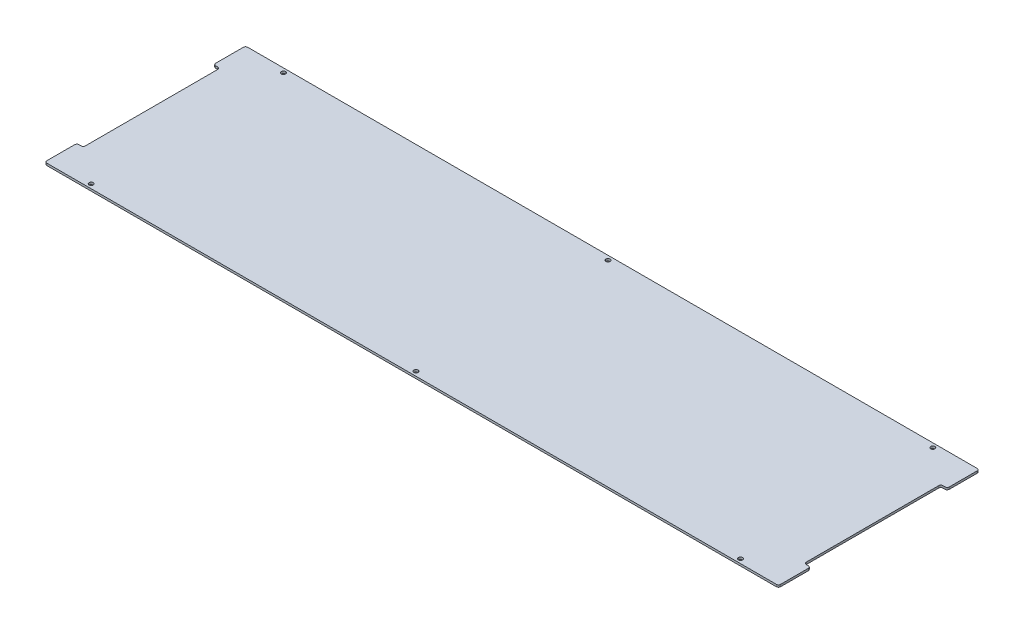
ISO-10303-21;
HEADER;
FILE_DESCRIPTION(('STEP AP214'),'2;1');
FILE_NAME('part.step','',(''),(''),'','','');
FILE_SCHEMA(('AUTOMOTIVE_DESIGN { 1 0 10303 214 1 1 1 1 }'));
ENDSEC;
DATA;
#1=APPLICATION_CONTEXT('core data for automotive mechanical design processes');
#2=APPLICATION_PROTOCOL_DEFINITION('international standard','automotive_design',2000,#1);
#3=PRODUCT_CONTEXT('',#1,'mechanical');
#4=PRODUCT('Part','Part','',(#3));
#5=PRODUCT_RELATED_PRODUCT_CATEGORY('part','',(#4));
#6=PRODUCT_DEFINITION_FORMATION('','',#4);
#7=PRODUCT_DEFINITION_CONTEXT('part definition',#1,'design');
#8=PRODUCT_DEFINITION('design','',#6,#7);
#9=PRODUCT_DEFINITION_SHAPE('','',#8);
#10=(LENGTH_UNIT() NAMED_UNIT(*) SI_UNIT(.MILLI.,.METRE.));
#11=(NAMED_UNIT(*) PLANE_ANGLE_UNIT() SI_UNIT($,.RADIAN.));
#12=(NAMED_UNIT(*) SI_UNIT($,.STERADIAN.) SOLID_ANGLE_UNIT());
#13=UNCERTAINTY_MEASURE_WITH_UNIT(LENGTH_MEASURE(1.E-05),#10,'distance_accuracy_value','');
#14=(GEOMETRIC_REPRESENTATION_CONTEXT(3) GLOBAL_UNCERTAINTY_ASSIGNED_CONTEXT((#13)) GLOBAL_UNIT_ASSIGNED_CONTEXT((#10,
#11,#12)) REPRESENTATION_CONTEXT('',''));
#15=CARTESIAN_POINT('',(0.,0.,0.));
#16=DIRECTION('',(0.,0.,1.));
#17=DIRECTION('',(1.,0.,0.));
#18=AXIS2_PLACEMENT_3D('',#15,#16,#17);
#19=CARTESIAN_POINT('',(0.,3.175,0.));
#20=DIRECTION('',(0.,-1.,0.));
#21=DIRECTION('',(0.,0.,-1.));
#22=AXIS2_PLACEMENT_3D('',#19,#20,#21);
#23=PLANE('',#22);
#24=CARTESIAN_POINT('',(482.6,3.175,142.875));
#25=DIRECTION('',(0.,1.,0.));
#26=DIRECTION('',(0.,0.,1.));
#27=AXIS2_PLACEMENT_3D('',#24,#25,#26);
#28=CIRCLE('',#27,3.17499999999998);
#29=CARTESIAN_POINT('',(482.6,3.175,146.05));
#30=VERTEX_POINT('',#29);
#31=EDGE_CURVE('E630',#30,#30,#28,.T.);
#32=ORIENTED_EDGE('',*,*,#31,.F.);
#33=EDGE_LOOP('',(#32));
#34=FACE_BOUND('',#33,.T.);
#35=CARTESIAN_POINT('',(-482.6,3.175,142.875));
#36=DIRECTION('',(0.,1.,0.));
#37=DIRECTION('',(0.,0.,1.));
#38=AXIS2_PLACEMENT_3D('',#35,#36,#37);
#39=CIRCLE('',#38,3.17499999999998);
#40=CARTESIAN_POINT('',(-482.6,3.175,146.05));
#41=VERTEX_POINT('',#40);
#42=EDGE_CURVE('E607',#41,#41,#39,.T.);
#43=ORIENTED_EDGE('',*,*,#42,.F.);
#44=EDGE_LOOP('',(#43));
#45=FACE_BOUND('',#44,.T.);
#46=CARTESIAN_POINT('',(482.6,3.175,-142.875));
#47=DIRECTION('',(0.,1.,0.));
#48=DIRECTION('',(0.,0.,1.));
#49=AXIS2_PLACEMENT_3D('',#46,#47,#48);
#50=CIRCLE('',#49,3.17499999999998);
#51=CARTESIAN_POINT('',(482.6,3.175,-139.7));
#52=VERTEX_POINT('',#51);
#53=EDGE_CURVE('E596',#52,#52,#50,.T.);
#54=ORIENTED_EDGE('',*,*,#53,.F.);
#55=EDGE_LOOP('',(#54));
#56=FACE_BOUND('',#55,.T.);
#57=CARTESIAN_POINT('',(0.,3.175,-142.875));
#58=DIRECTION('',(0.,1.,0.));
#59=DIRECTION('',(0.,0.,1.));
#60=AXIS2_PLACEMENT_3D('',#57,#58,#59);
#61=CIRCLE('',#60,3.17499999999999);
#62=CARTESIAN_POINT('',(0.,3.175,-139.7));
#63=VERTEX_POINT('',#62);
#64=EDGE_CURVE('E583',#63,#63,#61,.T.);
#65=ORIENTED_EDGE('',*,*,#64,.F.);
#66=EDGE_LOOP('',(#65));
#67=FACE_BOUND('',#66,.T.);
#68=CARTESIAN_POINT('',(-482.6,3.175,-142.875));
#69=DIRECTION('',(0.,1.,0.));
#70=DIRECTION('',(0.,0.,1.));
#71=AXIS2_PLACEMENT_3D('',#68,#69,#70);
#72=CIRCLE('',#71,3.17499999999998);
#73=CARTESIAN_POINT('',(-482.6,3.175,-139.7));
#74=VERTEX_POINT('',#73);
#75=EDGE_CURVE('E572',#74,#74,#72,.T.);
#76=ORIENTED_EDGE('',*,*,#75,.F.);
#77=EDGE_LOOP('',(#76));
#78=FACE_BOUND('',#77,.T.);
#79=DIRECTION('',(0.,0.,1.));
#80=VECTOR('',#79,1.);
#81=CARTESIAN_POINT('',(-545.30625,3.175,149.225));
#82=LINE('',#81,#80);
#83=CARTESIAN_POINT('',(-545.30625,3.175,104.775));
#84=VERTEX_POINT('',#83);
#85=CARTESIAN_POINT('',(-545.30625,3.175,146.05));
#86=VERTEX_POINT('',#85);
#87=EDGE_CURVE('E312',#84,#86,#82,.T.);
#88=ORIENTED_EDGE('',*,*,#87,.T.);
#89=CARTESIAN_POINT('',(-542.13125,3.175,146.05));
#90=DIRECTION('',(0.,-1.,0.));
#91=DIRECTION('',(0.,0.,-1.));
#92=AXIS2_PLACEMENT_3D('',#89,#90,#91);
#93=CIRCLE('',#92,3.175);
#94=CARTESIAN_POINT('',(-542.13125,3.175,149.225));
#95=VERTEX_POINT('',#94);
#96=EDGE_CURVE('E434',#86,#95,#93,.F.);
#97=ORIENTED_EDGE('',*,*,#96,.T.);
#98=DIRECTION('',(1.,0.,0.));
#99=VECTOR('',#98,1.);
#100=CARTESIAN_POINT('',(-545.30625,3.175,149.225));
#101=LINE('',#100,#99);
#102=CARTESIAN_POINT('',(542.13125,3.175,149.225));
#103=VERTEX_POINT('',#102);
#104=EDGE_CURVE('E282',#95,#103,#101,.T.);
#105=ORIENTED_EDGE('',*,*,#104,.T.);
#106=CARTESIAN_POINT('',(542.13125,3.175,146.05));
#107=DIRECTION('',(0.,-1.,0.));
#108=DIRECTION('',(0.,0.,-1.));
#109=AXIS2_PLACEMENT_3D('',#106,#107,#108);
#110=CIRCLE('',#109,3.175);
#111=CARTESIAN_POINT('',(545.30625,3.175,146.05));
#112=VERTEX_POINT('',#111);
#113=EDGE_CURVE('E424',#103,#112,#110,.F.);
#114=ORIENTED_EDGE('',*,*,#113,.T.);
#115=DIRECTION('',(0.,0.,-1.));
#116=VECTOR('',#115,1.);
#117=CARTESIAN_POINT('',(545.30625,3.175,149.225));
#118=LINE('',#117,#116);
#119=CARTESIAN_POINT('',(545.30625,3.175,104.775));
#120=VERTEX_POINT('',#119);
#121=EDGE_CURVE('E307',#112,#120,#118,.T.);
#122=ORIENTED_EDGE('',*,*,#121,.T.);
#123=CARTESIAN_POINT('',(542.13125,3.175,104.775));
#124=DIRECTION('',(0.,-1.,0.));
#125=DIRECTION('',(0.,0.,-1.));
#126=AXIS2_PLACEMENT_3D('',#123,#124,#125);
#127=CIRCLE('',#126,3.175);
#128=CARTESIAN_POINT('',(542.13125,3.175,101.6));
#129=VERTEX_POINT('',#128);
#130=EDGE_CURVE('E287',#120,#129,#127,.F.);
#131=ORIENTED_EDGE('',*,*,#130,.T.);
#132=DIRECTION('',(1.,0.,0.));
#133=VECTOR('',#132,1.);
#134=CARTESIAN_POINT('',(545.30625,3.175,101.6));
#135=LINE('',#134,#133);
#136=CARTESIAN_POINT('',(538.95625,3.175,101.6));
#137=VERTEX_POINT('',#136);
#138=EDGE_CURVE('E276',#137,#129,#135,.T.);
#139=ORIENTED_EDGE('',*,*,#138,.F.);
#140=CARTESIAN_POINT('',(538.95625,3.175,98.425));
#141=DIRECTION('',(0.,-1.,0.));
#142=DIRECTION('',(0.,0.,-1.));
#143=AXIS2_PLACEMENT_3D('',#140,#141,#142);
#144=CIRCLE('',#143,3.175);
#145=CARTESIAN_POINT('',(535.78125,3.175,98.4249999999999));
#146=VERTEX_POINT('',#145);
#147=EDGE_CURVE('E259',#137,#146,#144,.T.);
#148=ORIENTED_EDGE('',*,*,#147,.T.);
#149=DIRECTION('',(0.,0.,1.));
#150=VECTOR('',#149,1.);
#151=CARTESIAN_POINT('',(535.78125,3.175,-101.6));
#152=LINE('',#151,#150);
#153=CARTESIAN_POINT('',(535.78125,3.175,-98.425));
#154=VERTEX_POINT('',#153);
#155=EDGE_CURVE('E290',#154,#146,#152,.T.);
#156=ORIENTED_EDGE('',*,*,#155,.F.);
#157=CARTESIAN_POINT('',(538.95625,3.175,-98.425));
#158=DIRECTION('',(0.,-1.,0.));
#159=DIRECTION('',(0.,0.,-1.));
#160=AXIS2_PLACEMENT_3D('',#157,#158,#159);
#161=CIRCLE('',#160,3.175);
#162=CARTESIAN_POINT('',(538.95625,3.175,-101.6));
#163=VERTEX_POINT('',#162);
#164=EDGE_CURVE('E345',#154,#163,#161,.T.);
#165=ORIENTED_EDGE('',*,*,#164,.T.);
#166=DIRECTION('',(-1.,0.,0.));
#167=VECTOR('',#166,1.);
#168=CARTESIAN_POINT('',(545.30625,3.175,-101.6));
#169=LINE('',#168,#167);
#170=CARTESIAN_POINT('',(542.13125,3.175,-101.6));
#171=VERTEX_POINT('',#170);
#172=EDGE_CURVE('E299',#171,#163,#169,.T.);
#173=ORIENTED_EDGE('',*,*,#172,.F.);
#174=CARTESIAN_POINT('',(542.13125,3.175,-104.775));
#175=DIRECTION('',(0.,-1.,0.));
#176=DIRECTION('',(0.,0.,-1.));
#177=AXIS2_PLACEMENT_3D('',#174,#175,#176);
#178=CIRCLE('',#177,3.175);
#179=CARTESIAN_POINT('',(545.30625,3.175,-104.775));
#180=VERTEX_POINT('',#179);
#181=EDGE_CURVE('E419',#171,#180,#178,.F.);
#182=ORIENTED_EDGE('',*,*,#181,.T.);
#183=CARTESIAN_POINT('',(545.30625,3.175,-146.05));
#184=VERTEX_POINT('',#183);
#185=EDGE_CURVE('E303',#180,#184,#118,.T.);
#186=ORIENTED_EDGE('',*,*,#185,.T.);
#187=CARTESIAN_POINT('',(542.13125,3.175,-146.05));
#188=DIRECTION('',(0.,-1.,0.));
#189=DIRECTION('',(0.,0.,-1.));
#190=AXIS2_PLACEMENT_3D('',#187,#188,#189);
#191=CIRCLE('',#190,3.175);
#192=CARTESIAN_POINT('',(542.13125,3.175,-149.225));
#193=VERTEX_POINT('',#192);
#194=EDGE_CURVE('E416',#184,#193,#191,.F.);
#195=ORIENTED_EDGE('',*,*,#194,.T.);
#196=DIRECTION('',(-1.,0.,0.));
#197=VECTOR('',#196,1.);
#198=CARTESIAN_POINT('',(-545.30625,3.175,-149.225));
#199=LINE('',#198,#197);
#200=CARTESIAN_POINT('',(-542.13125,3.175,-149.225));
#201=VERTEX_POINT('',#200);
#202=EDGE_CURVE('E309',#193,#201,#199,.T.);
#203=ORIENTED_EDGE('',*,*,#202,.T.);
#204=CARTESIAN_POINT('',(-542.13125,3.175,-146.05));
#205=DIRECTION('',(0.,-1.,0.));
#206=DIRECTION('',(0.,0.,-1.));
#207=AXIS2_PLACEMENT_3D('',#204,#205,#206);
#208=CIRCLE('',#207,3.175);
#209=CARTESIAN_POINT('',(-545.30625,3.175,-146.05));
#210=VERTEX_POINT('',#209);
#211=EDGE_CURVE('E90',#201,#210,#208,.F.);
#212=ORIENTED_EDGE('',*,*,#211,.T.);
#213=CARTESIAN_POINT('',(-545.30625,3.175,-104.775));
#214=VERTEX_POINT('',#213);
#215=EDGE_CURVE('E313',#210,#214,#82,.T.);
#216=ORIENTED_EDGE('',*,*,#215,.T.);
#217=CARTESIAN_POINT('',(-542.13125,3.175,-104.775));
#218=DIRECTION('',(0.,-1.,0.));
#219=DIRECTION('',(0.,0.,-1.));
#220=AXIS2_PLACEMENT_3D('',#217,#218,#219);
#221=CIRCLE('',#220,3.175);
#222=CARTESIAN_POINT('',(-542.13125,3.175,-101.6));
#223=VERTEX_POINT('',#222);
#224=EDGE_CURVE('E82',#214,#223,#221,.F.);
#225=ORIENTED_EDGE('',*,*,#224,.T.);
#226=DIRECTION('',(1.,0.,0.));
#227=VECTOR('',#226,1.);
#228=CARTESIAN_POINT('',(-545.30625,3.175,-101.6));
#229=LINE('',#228,#227);
#230=CARTESIAN_POINT('',(-538.95625,3.175,-101.6));
#231=VERTEX_POINT('',#230);
#232=EDGE_CURVE('E502',#223,#231,#229,.T.);
#233=ORIENTED_EDGE('',*,*,#232,.T.);
#234=CARTESIAN_POINT('',(-538.95625,3.175,-98.425));
#235=DIRECTION('',(0.,-1.,0.));
#236=DIRECTION('',(0.,0.,-1.));
#237=AXIS2_PLACEMENT_3D('',#234,#235,#236);
#238=CIRCLE('',#237,3.175);
#239=CARTESIAN_POINT('',(-535.78125,3.175,-98.425));
#240=VERTEX_POINT('',#239);
#241=EDGE_CURVE('E372',#231,#240,#238,.T.);
#242=ORIENTED_EDGE('',*,*,#241,.T.);
#243=DIRECTION('',(0.,0.,1.));
#244=VECTOR('',#243,1.);
#245=CARTESIAN_POINT('',(-535.78125,3.175,-101.6));
#246=LINE('',#245,#244);
#247=CARTESIAN_POINT('',(-535.78125,3.175,98.4249999999999));
#248=VERTEX_POINT('',#247);
#249=EDGE_CURVE('E510',#240,#248,#246,.T.);
#250=ORIENTED_EDGE('',*,*,#249,.T.);
#251=CARTESIAN_POINT('',(-538.95625,3.175,98.425));
#252=DIRECTION('',(0.,-1.,0.));
#253=DIRECTION('',(0.,0.,-1.));
#254=AXIS2_PLACEMENT_3D('',#251,#252,#253);
#255=CIRCLE('',#254,3.175);
#256=CARTESIAN_POINT('',(-538.95625,3.175,101.6));
#257=VERTEX_POINT('',#256);
#258=EDGE_CURVE('E366',#248,#257,#255,.T.);
#259=ORIENTED_EDGE('',*,*,#258,.T.);
#260=DIRECTION('',(-1.,0.,0.));
#261=VECTOR('',#260,1.);
#262=CARTESIAN_POINT('',(-545.30625,3.175,101.6));
#263=LINE('',#262,#261);
#264=CARTESIAN_POINT('',(-542.13125,3.175,101.6));
#265=VERTEX_POINT('',#264);
#266=EDGE_CURVE('E527',#257,#265,#263,.T.);
#267=ORIENTED_EDGE('',*,*,#266,.T.);
#268=CARTESIAN_POINT('',(-542.13125,3.175,104.775));
#269=DIRECTION('',(0.,-1.,0.));
#270=DIRECTION('',(0.,0.,-1.));
#271=AXIS2_PLACEMENT_3D('',#268,#269,#270);
#272=CIRCLE('',#271,3.175);
#273=EDGE_CURVE('E431',#265,#84,#272,.F.);
#274=ORIENTED_EDGE('',*,*,#273,.T.);
#275=EDGE_LOOP('',(#88,#97,#105,#114,#122,#131,#139,#148,#156,#165,#173,#182,#186,#195,#203,
#212,#216,#225,#233,#242,#250,#259,#267,#274));
#276=FACE_BOUND('',#275,.T.);
#277=CARTESIAN_POINT('',(0.,3.175,142.875));
#278=DIRECTION('',(0.,1.,0.));
#279=DIRECTION('',(0.,0.,1.));
#280=AXIS2_PLACEMENT_3D('',#277,#278,#279);
#281=CIRCLE('',#280,3.17499999999999);
#282=CARTESIAN_POINT('',(0.,3.175,146.05));
#283=VERTEX_POINT('',#282);
#284=EDGE_CURVE('E618',#283,#283,#281,.T.);
#285=ORIENTED_EDGE('',*,*,#284,.F.);
#286=EDGE_LOOP('',(#285));
#287=FACE_BOUND('',#286,.T.);
#288=ADVANCED_FACE('F63',(#34,#45,#56,#67,#78,#276,#287),#23,.F.);
#289=CARTESIAN_POINT('',(0.,0.,0.));
#290=DIRECTION('',(0.,-1.,0.));
#291=DIRECTION('',(0.,0.,-1.));
#292=AXIS2_PLACEMENT_3D('',#289,#290,#291);
#293=PLANE('',#292);
#294=CARTESIAN_POINT('',(482.6,0.,142.875));
#295=DIRECTION('',(0.,1.,0.));
#296=DIRECTION('',(0.,0.,1.));
#297=AXIS2_PLACEMENT_3D('',#294,#295,#296);
#298=CIRCLE('',#297,3.17499999999998);
#299=CARTESIAN_POINT('',(482.6,0.,146.05));
#300=VERTEX_POINT('',#299);
#301=EDGE_CURVE('E624',#300,#300,#298,.T.);
#302=ORIENTED_EDGE('',*,*,#301,.T.);
#303=EDGE_LOOP('',(#302));
#304=FACE_BOUND('',#303,.T.);
#305=DIRECTION('',(1.,0.,0.));
#306=VECTOR('',#305,1.);
#307=CARTESIAN_POINT('',(-545.30625,0.,149.225));
#308=LINE('',#307,#306);
#309=CARTESIAN_POINT('',(-542.13125,0.,149.225));
#310=VERTEX_POINT('',#309);
#311=CARTESIAN_POINT('',(542.13125,0.,149.225));
#312=VERTEX_POINT('',#311);
#313=EDGE_CURVE('E308',#310,#312,#308,.T.);
#314=ORIENTED_EDGE('',*,*,#313,.F.);
#315=CARTESIAN_POINT('',(-542.13125,0.,146.05));
#316=DIRECTION('',(0.,-1.,0.));
#317=DIRECTION('',(0.,0.,-1.));
#318=AXIS2_PLACEMENT_3D('',#315,#316,#317);
#319=CIRCLE('',#318,3.175);
#320=CARTESIAN_POINT('',(-545.30625,0.,146.05));
#321=VERTEX_POINT('',#320);
#322=EDGE_CURVE('E407',#310,#321,#319,.T.);
#323=ORIENTED_EDGE('',*,*,#322,.T.);
#324=DIRECTION('',(0.,0.,1.));
#325=VECTOR('',#324,1.);
#326=CARTESIAN_POINT('',(-545.30625,0.,149.225));
#327=LINE('',#326,#325);
#328=CARTESIAN_POINT('',(-545.30625,0.,104.775));
#329=VERTEX_POINT('',#328);
#330=EDGE_CURVE('E328',#329,#321,#327,.T.);
#331=ORIENTED_EDGE('',*,*,#330,.F.);
#332=CARTESIAN_POINT('',(-542.13125,0.,104.775));
#333=DIRECTION('',(0.,-1.,0.));
#334=DIRECTION('',(0.,0.,-1.));
#335=AXIS2_PLACEMENT_3D('',#332,#333,#334);
#336=CIRCLE('',#335,3.175);
#337=CARTESIAN_POINT('',(-542.13125,0.,101.6));
#338=VERTEX_POINT('',#337);
#339=EDGE_CURVE('E404',#329,#338,#336,.T.);
#340=ORIENTED_EDGE('',*,*,#339,.T.);
#341=DIRECTION('',(-1.,0.,0.));
#342=VECTOR('',#341,1.);
#343=CARTESIAN_POINT('',(-545.30625,0.,101.6));
#344=LINE('',#343,#342);
#345=CARTESIAN_POINT('',(-538.95625,0.,101.6));
#346=VERTEX_POINT('',#345);
#347=EDGE_CURVE('E509',#346,#338,#344,.T.);
#348=ORIENTED_EDGE('',*,*,#347,.F.);
#349=CARTESIAN_POINT('',(-538.95625,0.,98.425));
#350=DIRECTION('',(0.,-1.,0.));
#351=DIRECTION('',(0.,0.,-1.));
#352=AXIS2_PLACEMENT_3D('',#349,#350,#351);
#353=CIRCLE('',#352,3.175);
#354=CARTESIAN_POINT('',(-535.78125,0.,98.4249999999999));
#355=VERTEX_POINT('',#354);
#356=EDGE_CURVE('E369',#346,#355,#353,.F.);
#357=ORIENTED_EDGE('',*,*,#356,.T.);
#358=DIRECTION('',(0.,0.,1.));
#359=VECTOR('',#358,1.);
#360=CARTESIAN_POINT('',(-535.78125,0.,-101.6));
#361=LINE('',#360,#359);
#362=CARTESIAN_POINT('',(-535.78125,0.,-98.425));
#363=VERTEX_POINT('',#362);
#364=EDGE_CURVE('E518',#363,#355,#361,.T.);
#365=ORIENTED_EDGE('',*,*,#364,.F.);
#366=CARTESIAN_POINT('',(-538.95625,0.,-98.425));
#367=DIRECTION('',(0.,-1.,0.));
#368=DIRECTION('',(0.,0.,-1.));
#369=AXIS2_PLACEMENT_3D('',#366,#367,#368);
#370=CIRCLE('',#369,3.175);
#371=CARTESIAN_POINT('',(-538.95625,0.,-101.6));
#372=VERTEX_POINT('',#371);
#373=EDGE_CURVE('E375',#363,#372,#370,.F.);
#374=ORIENTED_EDGE('',*,*,#373,.T.);
#375=DIRECTION('',(1.,0.,0.));
#376=VECTOR('',#375,1.);
#377=CARTESIAN_POINT('',(-545.30625,0.,-101.6));
#378=LINE('',#377,#376);
#379=CARTESIAN_POINT('',(-542.13125,0.,-101.6));
#380=VERTEX_POINT('',#379);
#381=EDGE_CURVE('E514',#380,#372,#378,.T.);
#382=ORIENTED_EDGE('',*,*,#381,.F.);
#383=CARTESIAN_POINT('',(-542.13125,0.,-104.775));
#384=DIRECTION('',(0.,-1.,0.));
#385=DIRECTION('',(0.,0.,-1.));
#386=AXIS2_PLACEMENT_3D('',#383,#384,#385);
#387=CIRCLE('',#386,3.175);
#388=CARTESIAN_POINT('',(-545.30625,0.,-104.775));
#389=VERTEX_POINT('',#388);
#390=EDGE_CURVE('E401',#380,#389,#387,.T.);
#391=ORIENTED_EDGE('',*,*,#390,.T.);
#392=CARTESIAN_POINT('',(-545.30625,0.,-146.05));
#393=VERTEX_POINT('',#392);
#394=EDGE_CURVE('E332',#393,#389,#327,.T.);
#395=ORIENTED_EDGE('',*,*,#394,.F.);
#396=CARTESIAN_POINT('',(-542.13125,0.,-146.05));
#397=DIRECTION('',(0.,-1.,0.));
#398=DIRECTION('',(0.,0.,-1.));
#399=AXIS2_PLACEMENT_3D('',#396,#397,#398);
#400=CIRCLE('',#399,3.175);
#401=CARTESIAN_POINT('',(-542.13125,0.,-149.225));
#402=VERTEX_POINT('',#401);
#403=EDGE_CURVE('E398',#393,#402,#400,.T.);
#404=ORIENTED_EDGE('',*,*,#403,.T.);
#405=DIRECTION('',(-1.,0.,0.));
#406=VECTOR('',#405,1.);
#407=CARTESIAN_POINT('',(-545.30625,0.,-149.225));
#408=LINE('',#407,#406);
#409=CARTESIAN_POINT('',(542.13125,0.,-149.225));
#410=VERTEX_POINT('',#409);
#411=EDGE_CURVE('E323',#410,#402,#408,.T.);
#412=ORIENTED_EDGE('',*,*,#411,.F.);
#413=CARTESIAN_POINT('',(542.13125,0.,-146.05));
#414=DIRECTION('',(0.,-1.,0.));
#415=DIRECTION('',(0.,0.,-1.));
#416=AXIS2_PLACEMENT_3D('',#413,#414,#415);
#417=CIRCLE('',#416,3.175);
#418=CARTESIAN_POINT('',(545.30625,0.,-146.05));
#419=VERTEX_POINT('',#418);
#420=EDGE_CURVE('E386',#410,#419,#417,.T.);
#421=ORIENTED_EDGE('',*,*,#420,.T.);
#422=DIRECTION('',(0.,0.,-1.));
#423=VECTOR('',#422,1.);
#424=CARTESIAN_POINT('',(545.30625,0.,149.225));
#425=LINE('',#424,#423);
#426=CARTESIAN_POINT('',(545.30625,0.,-104.775));
#427=VERTEX_POINT('',#426);
#428=EDGE_CURVE('E324',#427,#419,#425,.T.);
#429=ORIENTED_EDGE('',*,*,#428,.F.);
#430=CARTESIAN_POINT('',(542.13125,0.,-104.775));
#431=DIRECTION('',(0.,-1.,0.));
#432=DIRECTION('',(0.,0.,-1.));
#433=AXIS2_PLACEMENT_3D('',#430,#431,#432);
#434=CIRCLE('',#433,3.175);
#435=CARTESIAN_POINT('',(542.13125,0.,-101.6));
#436=VERTEX_POINT('',#435);
#437=EDGE_CURVE('E389',#427,#436,#434,.T.);
#438=ORIENTED_EDGE('',*,*,#437,.T.);
#439=DIRECTION('',(-1.,0.,0.));
#440=VECTOR('',#439,1.);
#441=CARTESIAN_POINT('',(545.30625,0.,-101.6));
#442=LINE('',#441,#440);
#443=CARTESIAN_POINT('',(538.95625,0.,-101.6));
#444=VERTEX_POINT('',#443);
#445=EDGE_CURVE('E289',#436,#444,#442,.T.);
#446=ORIENTED_EDGE('',*,*,#445,.T.);
#447=CARTESIAN_POINT('',(538.95625,0.,-98.425));
#448=DIRECTION('',(0.,-1.,0.));
#449=DIRECTION('',(0.,0.,-1.));
#450=AXIS2_PLACEMENT_3D('',#447,#448,#449);
#451=CIRCLE('',#450,3.175);
#452=CARTESIAN_POINT('',(535.78125,0.,-98.425));
#453=VERTEX_POINT('',#452);
#454=EDGE_CURVE('E349',#444,#453,#451,.F.);
#455=ORIENTED_EDGE('',*,*,#454,.T.);
#456=DIRECTION('',(0.,0.,1.));
#457=VECTOR('',#456,1.);
#458=CARTESIAN_POINT('',(535.78125,0.,-101.6));
#459=LINE('',#458,#457);
#460=CARTESIAN_POINT('',(535.78125,0.,98.4249999999999));
#461=VERTEX_POINT('',#460);
#462=EDGE_CURVE('E296',#453,#461,#459,.T.);
#463=ORIENTED_EDGE('',*,*,#462,.T.);
#464=CARTESIAN_POINT('',(538.95625,0.,98.425));
#465=DIRECTION('',(0.,-1.,0.));
#466=DIRECTION('',(0.,0.,-1.));
#467=AXIS2_PLACEMENT_3D('',#464,#465,#466);
#468=CIRCLE('',#467,3.175);
#469=CARTESIAN_POINT('',(538.95625,0.,101.6));
#470=VERTEX_POINT('',#469);
#471=EDGE_CURVE('E269',#461,#470,#468,.F.);
#472=ORIENTED_EDGE('',*,*,#471,.T.);
#473=DIRECTION('',(1.,0.,0.));
#474=VECTOR('',#473,1.);
#475=CARTESIAN_POINT('',(545.30625,0.,101.6));
#476=LINE('',#475,#474);
#477=CARTESIAN_POINT('',(542.13125,0.,101.6));
#478=VERTEX_POINT('',#477);
#479=EDGE_CURVE('E279',#470,#478,#476,.T.);
#480=ORIENTED_EDGE('',*,*,#479,.T.);
#481=CARTESIAN_POINT('',(542.13125,0.,104.775));
#482=DIRECTION('',(0.,-1.,0.));
#483=DIRECTION('',(0.,0.,-1.));
#484=AXIS2_PLACEMENT_3D('',#481,#482,#483);
#485=CIRCLE('',#484,3.175);
#486=CARTESIAN_POINT('',(545.30625,0.,104.775));
#487=VERTEX_POINT('',#486);
#488=EDGE_CURVE('E392',#478,#487,#485,.T.);
#489=ORIENTED_EDGE('',*,*,#488,.T.);
#490=CARTESIAN_POINT('',(545.30625,0.,146.05));
#491=VERTEX_POINT('',#490);
#492=EDGE_CURVE('E319',#491,#487,#425,.T.);
#493=ORIENTED_EDGE('',*,*,#492,.F.);
#494=CARTESIAN_POINT('',(542.13125,0.,146.05));
#495=DIRECTION('',(0.,-1.,0.));
#496=DIRECTION('',(0.,0.,-1.));
#497=AXIS2_PLACEMENT_3D('',#494,#495,#496);
#498=CIRCLE('',#497,3.175);
#499=EDGE_CURVE('E395',#491,#312,#498,.T.);
#500=ORIENTED_EDGE('',*,*,#499,.T.);
#501=EDGE_LOOP('',(#314,#323,#331,#340,#348,#357,#365,#374,#382,#391,#395,#404,#412,#421,#429,
#438,#446,#455,#463,#472,#480,#489,#493,#500));
#502=FACE_BOUND('',#501,.T.);
#503=CARTESIAN_POINT('',(-482.6,0.,-142.875));
#504=DIRECTION('',(0.,1.,0.));
#505=DIRECTION('',(0.,0.,1.));
#506=AXIS2_PLACEMENT_3D('',#503,#504,#505);
#507=CIRCLE('',#506,3.17499999999998);
#508=CARTESIAN_POINT('',(-482.6,0.,-139.7));
#509=VERTEX_POINT('',#508);
#510=EDGE_CURVE('E531',#509,#509,#507,.T.);
#511=ORIENTED_EDGE('',*,*,#510,.T.);
#512=EDGE_LOOP('',(#511));
#513=FACE_BOUND('',#512,.T.);
#514=CARTESIAN_POINT('',(0.,0.,-142.875));
#515=DIRECTION('',(0.,1.,0.));
#516=DIRECTION('',(0.,0.,1.));
#517=AXIS2_PLACEMENT_3D('',#514,#515,#516);
#518=CIRCLE('',#517,3.175);
#519=CARTESIAN_POINT('',(0.,0.,-139.7));
#520=VERTEX_POINT('',#519);
#521=EDGE_CURVE('E577',#520,#520,#518,.T.);
#522=ORIENTED_EDGE('',*,*,#521,.T.);
#523=EDGE_LOOP('',(#522));
#524=FACE_BOUND('',#523,.T.);
#525=CARTESIAN_POINT('',(482.6,0.,-142.875));
#526=DIRECTION('',(0.,1.,0.));
#527=DIRECTION('',(0.,0.,1.));
#528=AXIS2_PLACEMENT_3D('',#525,#526,#527);
#529=CIRCLE('',#528,3.17499999999998);
#530=CARTESIAN_POINT('',(482.6,0.,-139.7));
#531=VERTEX_POINT('',#530);
#532=EDGE_CURVE('E590',#531,#531,#529,.T.);
#533=ORIENTED_EDGE('',*,*,#532,.T.);
#534=EDGE_LOOP('',(#533));
#535=FACE_BOUND('',#534,.T.);
#536=CARTESIAN_POINT('',(-482.6,0.,142.875));
#537=DIRECTION('',(0.,1.,0.));
#538=DIRECTION('',(0.,0.,1.));
#539=AXIS2_PLACEMENT_3D('',#536,#537,#538);
#540=CIRCLE('',#539,3.17499999999998);
#541=CARTESIAN_POINT('',(-482.6,0.,146.05));
#542=VERTEX_POINT('',#541);
#543=EDGE_CURVE('E602',#542,#542,#540,.T.);
#544=ORIENTED_EDGE('',*,*,#543,.T.);
#545=EDGE_LOOP('',(#544));
#546=FACE_BOUND('',#545,.T.);
#547=CARTESIAN_POINT('',(0.,0.,142.875));
#548=DIRECTION('',(0.,1.,0.));
#549=DIRECTION('',(0.,0.,1.));
#550=AXIS2_PLACEMENT_3D('',#547,#548,#549);
#551=CIRCLE('',#550,3.175);
#552=CARTESIAN_POINT('',(0.,0.,146.05));
#553=VERTEX_POINT('',#552);
#554=EDGE_CURVE('E612',#553,#553,#551,.T.);
#555=ORIENTED_EDGE('',*,*,#554,.T.);
#556=EDGE_LOOP('',(#555));
#557=FACE_BOUND('',#556,.T.);
#558=ADVANCED_FACE('F492',(#304,#502,#513,#524,#535,#546,#557),#293,.T.);
#559=CARTESIAN_POINT('',(-545.30625,3.175,149.225));
#560=DIRECTION('',(1.,0.,0.));
#561=DIRECTION('',(0.,0.,-1.));
#562=AXIS2_PLACEMENT_3D('',#559,#560,#561);
#563=PLANE('',#562);
#564=ORIENTED_EDGE('',*,*,#394,.T.);
#565=DIRECTION('',(0.,1.,0.));
#566=VECTOR('',#565,1.);
#567=CARTESIAN_POINT('',(-545.30625,3.175,-104.775));
#568=LINE('',#567,#566);
#569=EDGE_CURVE('E445',#389,#214,#568,.T.);
#570=ORIENTED_EDGE('',*,*,#569,.T.);
#571=ORIENTED_EDGE('',*,*,#215,.F.);
#572=DIRECTION('',(0.,-1.,0.));
#573=VECTOR('',#572,1.);
#574=CARTESIAN_POINT('',(-545.30625,3.175,-146.05));
#575=LINE('',#574,#573);
#576=EDGE_CURVE('E441',#210,#393,#575,.T.);
#577=ORIENTED_EDGE('',*,*,#576,.T.);
#578=EDGE_LOOP('',(#564,#570,#571,#577));
#579=FACE_BOUND('',#578,.T.);
#580=ADVANCED_FACE('F500',(#579),#563,.F.);
#581=ORIENTED_EDGE('',*,*,#330,.T.);
#582=DIRECTION('',(0.,-1.,0.));
#583=VECTOR('',#582,1.);
#584=CARTESIAN_POINT('',(-545.30625,3.175,146.05));
#585=LINE('',#584,#583);
#586=EDGE_CURVE('E413',#321,#86,#585,.F.);
#587=ORIENTED_EDGE('',*,*,#586,.T.);
#588=ORIENTED_EDGE('',*,*,#87,.F.);
#589=DIRECTION('',(0.,1.,0.));
#590=VECTOR('',#589,1.);
#591=CARTESIAN_POINT('',(-545.30625,0.,104.775));
#592=LINE('',#591,#590);
#593=EDGE_CURVE('E410',#84,#329,#592,.F.);
#594=ORIENTED_EDGE('',*,*,#593,.T.);
#595=EDGE_LOOP('',(#581,#587,#588,#594));
#596=FACE_BOUND('',#595,.T.);
#597=ADVANCED_FACE('F652',(#596),#563,.F.);
#598=CARTESIAN_POINT('',(545.30625,3.175,149.225));
#599=DIRECTION('',(-1.,0.,0.));
#600=DIRECTION('',(0.,0.,1.));
#601=AXIS2_PLACEMENT_3D('',#598,#599,#600);
#602=PLANE('',#601);
#603=ORIENTED_EDGE('',*,*,#121,.F.);
#604=DIRECTION('',(0.,-1.,0.));
#605=VECTOR('',#604,1.);
#606=CARTESIAN_POINT('',(545.30625,3.175,146.05));
#607=LINE('',#606,#605);
#608=EDGE_CURVE('E462',#112,#491,#607,.T.);
#609=ORIENTED_EDGE('',*,*,#608,.T.);
#610=ORIENTED_EDGE('',*,*,#492,.T.);
#611=DIRECTION('',(0.,1.,0.));
#612=VECTOR('',#611,1.);
#613=CARTESIAN_POINT('',(545.30625,3.175,104.775));
#614=LINE('',#613,#612);
#615=EDGE_CURVE('E458',#487,#120,#614,.T.);
#616=ORIENTED_EDGE('',*,*,#615,.T.);
#617=EDGE_LOOP('',(#603,#609,#610,#616));
#618=FACE_BOUND('',#617,.T.);
#619=ADVANCED_FACE('F752',(#618),#602,.F.);
#620=ORIENTED_EDGE('',*,*,#185,.F.);
#621=DIRECTION('',(0.,1.,0.));
#622=VECTOR('',#621,1.);
#623=CARTESIAN_POINT('',(545.30625,3.175,-104.775));
#624=LINE('',#623,#622);
#625=EDGE_CURVE('E12',#180,#427,#624,.F.);
#626=ORIENTED_EDGE('',*,*,#625,.T.);
#627=ORIENTED_EDGE('',*,*,#428,.T.);
#628=DIRECTION('',(0.,-1.,0.));
#629=VECTOR('',#628,1.);
#630=CARTESIAN_POINT('',(545.30625,3.175,-146.05));
#631=LINE('',#630,#629);
#632=EDGE_CURVE('E72',#419,#184,#631,.F.);
#633=ORIENTED_EDGE('',*,*,#632,.T.);
#634=EDGE_LOOP('',(#620,#626,#627,#633));
#635=FACE_BOUND('',#634,.T.);
#636=ADVANCED_FACE('F478',(#635),#602,.F.);
#637=CARTESIAN_POINT('',(-545.30625,3.175,-149.225));
#638=DIRECTION('',(0.,0.,1.));
#639=DIRECTION('',(1.,0.,0.));
#640=AXIS2_PLACEMENT_3D('',#637,#638,#639);
#641=PLANE('',#640);
#642=ORIENTED_EDGE('',*,*,#411,.T.);
#643=DIRECTION('',(0.,-1.,0.));
#644=VECTOR('',#643,1.);
#645=CARTESIAN_POINT('',(-542.13125,3.175,-149.225));
#646=LINE('',#645,#644);
#647=EDGE_CURVE('E455',#402,#201,#646,.F.);
#648=ORIENTED_EDGE('',*,*,#647,.T.);
#649=ORIENTED_EDGE('',*,*,#202,.F.);
#650=DIRECTION('',(0.,-1.,0.));
#651=VECTOR('',#650,1.);
#652=CARTESIAN_POINT('',(542.13125,3.175,-149.225));
#653=LINE('',#652,#651);
#654=EDGE_CURVE('E451',#193,#410,#653,.T.);
#655=ORIENTED_EDGE('',*,*,#654,.T.);
#656=EDGE_LOOP('',(#642,#648,#649,#655));
#657=FACE_BOUND('',#656,.T.);
#658=ADVANCED_FACE('F488',(#657),#641,.F.);
#659=CARTESIAN_POINT('',(-545.30625,3.175,149.225));
#660=DIRECTION('',(0.,0.,-1.));
#661=DIRECTION('',(-1.,0.,0.));
#662=AXIS2_PLACEMENT_3D('',#659,#660,#661);
#663=PLANE('',#662);
#664=ORIENTED_EDGE('',*,*,#104,.F.);
#665=DIRECTION('',(0.,-1.,0.));
#666=VECTOR('',#665,1.);
#667=CARTESIAN_POINT('',(-542.13125,3.175,149.225));
#668=LINE('',#667,#666);
#669=EDGE_CURVE('E382',#95,#310,#668,.T.);
#670=ORIENTED_EDGE('',*,*,#669,.T.);
#671=ORIENTED_EDGE('',*,*,#313,.T.);
#672=DIRECTION('',(0.,-1.,0.));
#673=VECTOR('',#672,1.);
#674=CARTESIAN_POINT('',(542.13125,3.175,149.225));
#675=LINE('',#674,#673);
#676=EDGE_CURVE('E379',#312,#103,#675,.F.);
#677=ORIENTED_EDGE('',*,*,#676,.T.);
#678=EDGE_LOOP('',(#664,#670,#671,#677));
#679=FACE_BOUND('',#678,.T.);
#680=ADVANCED_FACE('F760',(#679),#663,.F.);
#681=CARTESIAN_POINT('',(545.30625,0.,101.6));
#682=DIRECTION('',(0.,0.,1.));
#683=DIRECTION('',(1.,0.,0.));
#684=AXIS2_PLACEMENT_3D('',#681,#682,#683);
#685=PLANE('',#684);
#686=ORIENTED_EDGE('',*,*,#138,.T.);
#687=DIRECTION('',(0.,1.,0.));
#688=VECTOR('',#687,1.);
#689=CARTESIAN_POINT('',(542.13125,0.,101.6));
#690=LINE('',#689,#688);
#691=EDGE_CURVE('E466',#129,#478,#690,.F.);
#692=ORIENTED_EDGE('',*,*,#691,.T.);
#693=ORIENTED_EDGE('',*,*,#479,.F.);
#694=DIRECTION('',(0.,1.,0.));
#695=VECTOR('',#694,1.);
#696=CARTESIAN_POINT('',(538.95625,3.175,101.6));
#697=LINE('',#696,#695);
#698=EDGE_CURVE('E263',#470,#137,#697,.T.);
#699=ORIENTED_EDGE('',*,*,#698,.T.);
#700=EDGE_LOOP('',(#686,#692,#693,#699));
#701=FACE_BOUND('',#700,.T.);
#702=ADVANCED_FACE('F275',(#701),#685,.F.);
#703=CARTESIAN_POINT('',(535.78125,0.,-101.6));
#704=DIRECTION('',(-1.,0.,0.));
#705=DIRECTION('',(0.,0.,1.));
#706=AXIS2_PLACEMENT_3D('',#703,#704,#705);
#707=PLANE('',#706);
#708=ORIENTED_EDGE('',*,*,#155,.T.);
#709=DIRECTION('',(0.,1.,0.));
#710=VECTOR('',#709,1.);
#711=CARTESIAN_POINT('',(535.78125,0.,98.425));
#712=LINE('',#711,#710);
#713=EDGE_CURVE('E264',#146,#461,#712,.F.);
#714=ORIENTED_EDGE('',*,*,#713,.T.);
#715=ORIENTED_EDGE('',*,*,#462,.F.);
#716=DIRECTION('',(0.,1.,0.));
#717=VECTOR('',#716,1.);
#718=CARTESIAN_POINT('',(535.78125,3.175,-98.425));
#719=LINE('',#718,#717);
#720=EDGE_CURVE('E281',#453,#154,#719,.T.);
#721=ORIENTED_EDGE('',*,*,#720,.T.);
#722=EDGE_LOOP('',(#708,#714,#715,#721));
#723=FACE_BOUND('',#722,.T.);
#724=ADVANCED_FACE('F831',(#723),#707,.F.);
#725=CARTESIAN_POINT('',(545.30625,0.,-101.6));
#726=DIRECTION('',(0.,0.,-1.));
#727=DIRECTION('',(-1.,0.,0.));
#728=AXIS2_PLACEMENT_3D('',#725,#726,#727);
#729=PLANE('',#728);
#730=ORIENTED_EDGE('',*,*,#445,.F.);
#731=DIRECTION('',(0.,1.,0.));
#732=VECTOR('',#731,1.);
#733=CARTESIAN_POINT('',(542.13125,0.,-101.6));
#734=LINE('',#733,#732);
#735=EDGE_CURVE('E469',#436,#171,#734,.T.);
#736=ORIENTED_EDGE('',*,*,#735,.T.);
#737=ORIENTED_EDGE('',*,*,#172,.T.);
#738=DIRECTION('',(0.,1.,0.));
#739=VECTOR('',#738,1.);
#740=CARTESIAN_POINT('',(538.95625,0.,-101.6));
#741=LINE('',#740,#739);
#742=EDGE_CURVE('E270',#163,#444,#741,.F.);
#743=ORIENTED_EDGE('',*,*,#742,.T.);
#744=EDGE_LOOP('',(#730,#736,#737,#743));
#745=FACE_BOUND('',#744,.T.);
#746=ADVANCED_FACE('F786',(#745),#729,.F.);
#747=CARTESIAN_POINT('',(538.95625,0.,98.425));
#748=DIRECTION('',(0.,-1.,0.));
#749=DIRECTION('',(0.,0.,-1.));
#750=AXIS2_PLACEMENT_3D('',#747,#748,#749);
#751=CYLINDRICAL_SURFACE('',#750,3.175);
#752=ORIENTED_EDGE('',*,*,#471,.F.);
#753=ORIENTED_EDGE('',*,*,#713,.F.);
#754=ORIENTED_EDGE('',*,*,#147,.F.);
#755=ORIENTED_EDGE('',*,*,#698,.F.);
#756=EDGE_LOOP('',(#752,#753,#754,#755));
#757=FACE_BOUND('',#756,.T.);
#758=ADVANCED_FACE('F262',(#757),#751,.F.);
#759=CARTESIAN_POINT('',(538.95625,0.,-98.425));
#760=DIRECTION('',(0.,-1.,0.));
#761=DIRECTION('',(0.,0.,-1.));
#762=AXIS2_PLACEMENT_3D('',#759,#760,#761);
#763=CYLINDRICAL_SURFACE('',#762,3.175);
#764=ORIENTED_EDGE('',*,*,#454,.F.);
#765=ORIENTED_EDGE('',*,*,#742,.F.);
#766=ORIENTED_EDGE('',*,*,#164,.F.);
#767=ORIENTED_EDGE('',*,*,#720,.F.);
#768=EDGE_LOOP('',(#764,#765,#766,#767));
#769=FACE_BOUND('',#768,.T.);
#770=ADVANCED_FACE('F799',(#769),#763,.F.);
#771=CARTESIAN_POINT('',(-545.30625,0.,-101.6));
#772=DIRECTION('',(0.,0.,1.));
#773=DIRECTION('',(1.,0.,0.));
#774=AXIS2_PLACEMENT_3D('',#771,#772,#773);
#775=PLANE('',#774);
#776=ORIENTED_EDGE('',*,*,#232,.F.);
#777=DIRECTION('',(0.,1.,0.));
#778=VECTOR('',#777,1.);
#779=CARTESIAN_POINT('',(-542.13125,0.,-101.6));
#780=LINE('',#779,#778);
#781=EDGE_CURVE('E448',#223,#380,#780,.F.);
#782=ORIENTED_EDGE('',*,*,#781,.T.);
#783=ORIENTED_EDGE('',*,*,#381,.T.);
#784=DIRECTION('',(0.,1.,0.));
#785=VECTOR('',#784,1.);
#786=CARTESIAN_POINT('',(-538.95625,3.175,-101.6));
#787=LINE('',#786,#785);
#788=EDGE_CURVE('E362',#372,#231,#787,.T.);
#789=ORIENTED_EDGE('',*,*,#788,.T.);
#790=EDGE_LOOP('',(#776,#782,#783,#789));
#791=FACE_BOUND('',#790,.T.);
#792=ADVANCED_FACE('F505',(#791),#775,.T.);
#793=CARTESIAN_POINT('',(-535.78125,0.,-101.6));
#794=DIRECTION('',(-1.,0.,0.));
#795=DIRECTION('',(0.,0.,1.));
#796=AXIS2_PLACEMENT_3D('',#793,#794,#795);
#797=PLANE('',#796);
#798=ORIENTED_EDGE('',*,*,#364,.T.);
#799=DIRECTION('',(0.,1.,0.));
#800=VECTOR('',#799,1.);
#801=CARTESIAN_POINT('',(-535.78125,3.175,98.425));
#802=LINE('',#801,#800);
#803=EDGE_CURVE('E355',#355,#248,#802,.T.);
#804=ORIENTED_EDGE('',*,*,#803,.T.);
#805=ORIENTED_EDGE('',*,*,#249,.F.);
#806=DIRECTION('',(0.,1.,0.));
#807=VECTOR('',#806,1.);
#808=CARTESIAN_POINT('',(-535.78125,0.,-98.425));
#809=LINE('',#808,#807);
#810=EDGE_CURVE('E352',#240,#363,#809,.F.);
#811=ORIENTED_EDGE('',*,*,#810,.T.);
#812=EDGE_LOOP('',(#798,#804,#805,#811));
#813=FACE_BOUND('',#812,.T.);
#814=ADVANCED_FACE('F819',(#813),#797,.T.);
#815=CARTESIAN_POINT('',(-545.30625,0.,101.6));
#816=DIRECTION('',(0.,0.,-1.));
#817=DIRECTION('',(-1.,0.,0.));
#818=AXIS2_PLACEMENT_3D('',#815,#816,#817);
#819=PLANE('',#818);
#820=ORIENTED_EDGE('',*,*,#347,.T.);
#821=DIRECTION('',(0.,1.,0.));
#822=VECTOR('',#821,1.);
#823=CARTESIAN_POINT('',(-542.13125,3.175,101.6));
#824=LINE('',#823,#822);
#825=EDGE_CURVE('E437',#338,#265,#824,.T.);
#826=ORIENTED_EDGE('',*,*,#825,.T.);
#827=ORIENTED_EDGE('',*,*,#266,.F.);
#828=DIRECTION('',(0.,1.,0.));
#829=VECTOR('',#828,1.);
#830=CARTESIAN_POINT('',(-538.95625,0.,101.6));
#831=LINE('',#830,#829);
#832=EDGE_CURVE('E359',#257,#346,#831,.F.);
#833=ORIENTED_EDGE('',*,*,#832,.T.);
#834=EDGE_LOOP('',(#820,#826,#827,#833));
#835=FACE_BOUND('',#834,.T.);
#836=ADVANCED_FACE('F641',(#835),#819,.T.);
#837=CARTESIAN_POINT('',(-538.95625,0.,98.425));
#838=DIRECTION('',(0.,-1.,0.));
#839=DIRECTION('',(0.,0.,-1.));
#840=AXIS2_PLACEMENT_3D('',#837,#838,#839);
#841=CYLINDRICAL_SURFACE('',#840,3.175);
#842=ORIENTED_EDGE('',*,*,#356,.F.);
#843=ORIENTED_EDGE('',*,*,#832,.F.);
#844=ORIENTED_EDGE('',*,*,#258,.F.);
#845=ORIENTED_EDGE('',*,*,#803,.F.);
#846=EDGE_LOOP('',(#842,#843,#844,#845));
#847=FACE_BOUND('',#846,.T.);
#848=ADVANCED_FACE('F803',(#847),#841,.F.);
#849=CARTESIAN_POINT('',(-538.95625,0.,-98.425));
#850=DIRECTION('',(0.,-1.,0.));
#851=DIRECTION('',(0.,0.,-1.));
#852=AXIS2_PLACEMENT_3D('',#849,#850,#851);
#853=CYLINDRICAL_SURFACE('',#852,3.175);
#854=ORIENTED_EDGE('',*,*,#373,.F.);
#855=ORIENTED_EDGE('',*,*,#810,.F.);
#856=ORIENTED_EDGE('',*,*,#241,.F.);
#857=ORIENTED_EDGE('',*,*,#788,.F.);
#858=EDGE_LOOP('',(#854,#855,#856,#857));
#859=FACE_BOUND('',#858,.T.);
#860=ADVANCED_FACE('F805',(#859),#853,.F.);
#861=CARTESIAN_POINT('',(-482.6,3.175,-142.875));
#862=DIRECTION('',(0.,1.,0.));
#863=DIRECTION('',(0.,0.,1.));
#864=AXIS2_PLACEMENT_3D('',#861,#862,#863);
#865=CYLINDRICAL_SURFACE('',#864,3.17499999999998);
#866=ORIENTED_EDGE('',*,*,#510,.F.);
#867=EDGE_LOOP('',(#866));
#868=FACE_BOUND('',#867,.T.);
#869=ORIENTED_EDGE('',*,*,#75,.T.);
#870=EDGE_LOOP('',(#869));
#871=FACE_BOUND('',#870,.T.);
#872=ADVANCED_FACE('F808',(#868,#871),#865,.F.);
#873=CARTESIAN_POINT('',(0.,3.175,-142.875));
#874=DIRECTION('',(0.,1.,0.));
#875=DIRECTION('',(0.,0.,1.));
#876=AXIS2_PLACEMENT_3D('',#873,#874,#875);
#877=CYLINDRICAL_SURFACE('',#876,3.17499999999999);
#878=ORIENTED_EDGE('',*,*,#521,.F.);
#879=EDGE_LOOP('',(#878));
#880=FACE_BOUND('',#879,.T.);
#881=ORIENTED_EDGE('',*,*,#64,.T.);
#882=EDGE_LOOP('',(#881));
#883=FACE_BOUND('',#882,.T.);
#884=ADVANCED_FACE('F813',(#880,#883),#877,.F.);
#885=CARTESIAN_POINT('',(482.6,3.175,-142.875));
#886=DIRECTION('',(0.,1.,0.));
#887=DIRECTION('',(0.,0.,1.));
#888=AXIS2_PLACEMENT_3D('',#885,#886,#887);
#889=CYLINDRICAL_SURFACE('',#888,3.17499999999998);
#890=ORIENTED_EDGE('',*,*,#532,.F.);
#891=EDGE_LOOP('',(#890));
#892=FACE_BOUND('',#891,.T.);
#893=ORIENTED_EDGE('',*,*,#53,.T.);
#894=EDGE_LOOP('',(#893));
#895=FACE_BOUND('',#894,.T.);
#896=ADVANCED_FACE('F943',(#892,#895),#889,.F.);
#897=CARTESIAN_POINT('',(-482.6,3.175,142.875));
#898=DIRECTION('',(0.,1.,0.));
#899=DIRECTION('',(0.,0.,1.));
#900=AXIS2_PLACEMENT_3D('',#897,#898,#899);
#901=CYLINDRICAL_SURFACE('',#900,3.17499999999998);
#902=ORIENTED_EDGE('',*,*,#543,.F.);
#903=EDGE_LOOP('',(#902));
#904=FACE_BOUND('',#903,.T.);
#905=ORIENTED_EDGE('',*,*,#42,.T.);
#906=EDGE_LOOP('',(#905));
#907=FACE_BOUND('',#906,.T.);
#908=ADVANCED_FACE('F933',(#904,#907),#901,.F.);
#909=CARTESIAN_POINT('',(0.,3.175,142.875));
#910=DIRECTION('',(0.,1.,0.));
#911=DIRECTION('',(0.,0.,1.));
#912=AXIS2_PLACEMENT_3D('',#909,#910,#911);
#913=CYLINDRICAL_SURFACE('',#912,3.17499999999999);
#914=ORIENTED_EDGE('',*,*,#554,.F.);
#915=EDGE_LOOP('',(#914));
#916=FACE_BOUND('',#915,.T.);
#917=ORIENTED_EDGE('',*,*,#284,.T.);
#918=EDGE_LOOP('',(#917));
#919=FACE_BOUND('',#918,.T.);
#920=ADVANCED_FACE('F772',(#916,#919),#913,.F.);
#921=CARTESIAN_POINT('',(482.6,3.175,142.875));
#922=DIRECTION('',(0.,1.,0.));
#923=DIRECTION('',(0.,0.,1.));
#924=AXIS2_PLACEMENT_3D('',#921,#922,#923);
#925=CYLINDRICAL_SURFACE('',#924,3.17499999999998);
#926=ORIENTED_EDGE('',*,*,#301,.F.);
#927=EDGE_LOOP('',(#926));
#928=FACE_BOUND('',#927,.T.);
#929=ORIENTED_EDGE('',*,*,#31,.T.);
#930=EDGE_LOOP('',(#929));
#931=FACE_BOUND('',#930,.T.);
#932=ADVANCED_FACE('F765',(#928,#931),#925,.F.);
#933=CARTESIAN_POINT('',(-542.13125,3.175,146.05));
#934=DIRECTION('',(0.,-1.,0.));
#935=DIRECTION('',(0.,0.,-1.));
#936=AXIS2_PLACEMENT_3D('',#933,#934,#935);
#937=CYLINDRICAL_SURFACE('',#936,3.175);
#938=ORIENTED_EDGE('',*,*,#96,.F.);
#939=ORIENTED_EDGE('',*,*,#586,.F.);
#940=ORIENTED_EDGE('',*,*,#322,.F.);
#941=ORIENTED_EDGE('',*,*,#669,.F.);
#942=EDGE_LOOP('',(#938,#939,#940,#941));
#943=FACE_BOUND('',#942,.T.);
#944=ADVANCED_FACE('F763',(#943),#937,.T.);
#945=CARTESIAN_POINT('',(-542.13125,0.,104.775));
#946=DIRECTION('',(0.,-1.,0.));
#947=DIRECTION('',(0.,0.,-1.));
#948=AXIS2_PLACEMENT_3D('',#945,#946,#947);
#949=CYLINDRICAL_SURFACE('',#948,3.175);
#950=ORIENTED_EDGE('',*,*,#339,.F.);
#951=ORIENTED_EDGE('',*,*,#593,.F.);
#952=ORIENTED_EDGE('',*,*,#273,.F.);
#953=ORIENTED_EDGE('',*,*,#825,.F.);
#954=EDGE_LOOP('',(#950,#951,#952,#953));
#955=FACE_BOUND('',#954,.T.);
#956=ADVANCED_FACE('F647',(#955),#949,.T.);
#957=CARTESIAN_POINT('',(-542.13125,3.175,-104.775));
#958=DIRECTION('',(0.,-1.,0.));
#959=DIRECTION('',(0.,0.,-1.));
#960=AXIS2_PLACEMENT_3D('',#957,#958,#959);
#961=CYLINDRICAL_SURFACE('',#960,3.175);
#962=ORIENTED_EDGE('',*,*,#390,.F.);
#963=ORIENTED_EDGE('',*,*,#781,.F.);
#964=ORIENTED_EDGE('',*,*,#224,.F.);
#965=ORIENTED_EDGE('',*,*,#569,.F.);
#966=EDGE_LOOP('',(#962,#963,#964,#965));
#967=FACE_BOUND('',#966,.T.);
#968=ADVANCED_FACE('F513',(#967),#961,.T.);
#969=CARTESIAN_POINT('',(-542.13125,3.175,-146.05));
#970=DIRECTION('',(0.,-1.,0.));
#971=DIRECTION('',(0.,0.,-1.));
#972=AXIS2_PLACEMENT_3D('',#969,#970,#971);
#973=CYLINDRICAL_SURFACE('',#972,3.175);
#974=ORIENTED_EDGE('',*,*,#211,.F.);
#975=ORIENTED_EDGE('',*,*,#647,.F.);
#976=ORIENTED_EDGE('',*,*,#403,.F.);
#977=ORIENTED_EDGE('',*,*,#576,.F.);
#978=EDGE_LOOP('',(#974,#975,#976,#977));
#979=FACE_BOUND('',#978,.T.);
#980=ADVANCED_FACE('F498',(#979),#973,.T.);
#981=CARTESIAN_POINT('',(542.13125,3.175,146.05));
#982=DIRECTION('',(0.,-1.,0.));
#983=DIRECTION('',(0.,0.,-1.));
#984=AXIS2_PLACEMENT_3D('',#981,#982,#983);
#985=CYLINDRICAL_SURFACE('',#984,3.175);
#986=ORIENTED_EDGE('',*,*,#113,.F.);
#987=ORIENTED_EDGE('',*,*,#676,.F.);
#988=ORIENTED_EDGE('',*,*,#499,.F.);
#989=ORIENTED_EDGE('',*,*,#608,.F.);
#990=EDGE_LOOP('',(#986,#987,#988,#989));
#991=FACE_BOUND('',#990,.T.);
#992=ADVANCED_FACE('F756',(#991),#985,.T.);
#993=CARTESIAN_POINT('',(542.13125,3.175,104.775));
#994=DIRECTION('',(0.,1.,0.));
#995=DIRECTION('',(0.,0.,1.));
#996=AXIS2_PLACEMENT_3D('',#993,#994,#995);
#997=CYLINDRICAL_SURFACE('',#996,3.175);
#998=ORIENTED_EDGE('',*,*,#488,.F.);
#999=ORIENTED_EDGE('',*,*,#691,.F.);
#1000=ORIENTED_EDGE('',*,*,#130,.F.);
#1001=ORIENTED_EDGE('',*,*,#615,.F.);
#1002=EDGE_LOOP('',(#998,#999,#1000,#1001));
#1003=FACE_BOUND('',#1002,.T.);
#1004=ADVANCED_FACE('F848',(#1003),#997,.T.);
#1005=CARTESIAN_POINT('',(542.13125,0.,-104.775));
#1006=DIRECTION('',(0.,1.,0.));
#1007=DIRECTION('',(0.,0.,1.));
#1008=AXIS2_PLACEMENT_3D('',#1005,#1006,#1007);
#1009=CYLINDRICAL_SURFACE('',#1008,3.175);
#1010=ORIENTED_EDGE('',*,*,#437,.F.);
#1011=ORIENTED_EDGE('',*,*,#625,.F.);
#1012=ORIENTED_EDGE('',*,*,#181,.F.);
#1013=ORIENTED_EDGE('',*,*,#735,.F.);
#1014=EDGE_LOOP('',(#1010,#1011,#1012,#1013));
#1015=FACE_BOUND('',#1014,.T.);
#1016=ADVANCED_FACE('F846',(#1015),#1009,.T.);
#1017=CARTESIAN_POINT('',(542.13125,3.175,-146.05));
#1018=DIRECTION('',(0.,-1.,0.));
#1019=DIRECTION('',(0.,0.,-1.));
#1020=AXIS2_PLACEMENT_3D('',#1017,#1018,#1019);
#1021=CYLINDRICAL_SURFACE('',#1020,3.175);
#1022=ORIENTED_EDGE('',*,*,#194,.F.);
#1023=ORIENTED_EDGE('',*,*,#632,.F.);
#1024=ORIENTED_EDGE('',*,*,#420,.F.);
#1025=ORIENTED_EDGE('',*,*,#654,.F.);
#1026=EDGE_LOOP('',(#1022,#1023,#1024,#1025));
#1027=FACE_BOUND('',#1026,.T.);
#1028=ADVANCED_FACE('F65',(#1027),#1021,.T.);
#1029=CLOSED_SHELL('',(#288,#558,#580,#597,#619,#636,#658,#680,#702,#724,#746,#758,#770,#792,
#814,#836,#848,#860,#872,#884,#896,#908,#920,#932,#944,#956,#968,#980,#992,#1004,#1016,#1028));
#1030=MANIFOLD_SOLID_BREP('B2',#1029);
#1031=ADVANCED_BREP_SHAPE_REPRESENTATION('',(#18,#1030),#14);
#1032=SHAPE_DEFINITION_REPRESENTATION(#9,#1031);
ENDSEC;
END-ISO-10303-21;
